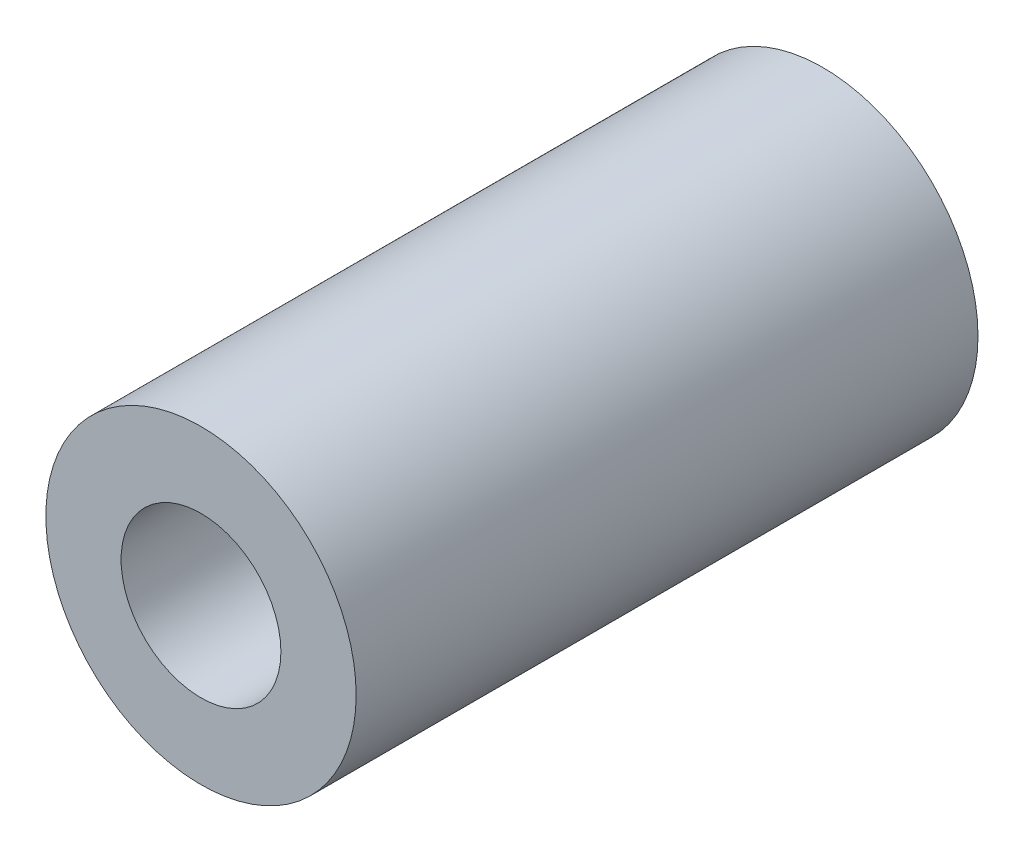
ISO-10303-21;
HEADER;
FILE_DESCRIPTION(('STEP AP214'),'2;1');
FILE_NAME('part.step','',(''),(''),'','','');
FILE_SCHEMA(('AUTOMOTIVE_DESIGN { 1 0 10303 214 1 1 1 1 }'));
ENDSEC;
DATA;
#1=APPLICATION_CONTEXT('core data for automotive mechanical design processes');
#2=APPLICATION_PROTOCOL_DEFINITION('international standard','automotive_design',2000,#1);
#3=PRODUCT_CONTEXT('',#1,'mechanical');
#4=PRODUCT('Part','Part','',(#3));
#5=PRODUCT_RELATED_PRODUCT_CATEGORY('part','',(#4));
#6=PRODUCT_DEFINITION_FORMATION('','',#4);
#7=PRODUCT_DEFINITION_CONTEXT('part definition',#1,'design');
#8=PRODUCT_DEFINITION('design','',#6,#7);
#9=PRODUCT_DEFINITION_SHAPE('','',#8);
#10=(LENGTH_UNIT() NAMED_UNIT(*) SI_UNIT(.MILLI.,.METRE.));
#11=(NAMED_UNIT(*) PLANE_ANGLE_UNIT() SI_UNIT($,.RADIAN.));
#12=(NAMED_UNIT(*) SI_UNIT($,.STERADIAN.) SOLID_ANGLE_UNIT());
#13=UNCERTAINTY_MEASURE_WITH_UNIT(LENGTH_MEASURE(1.E-05),#10,'distance_accuracy_value','');
#14=(GEOMETRIC_REPRESENTATION_CONTEXT(3) GLOBAL_UNCERTAINTY_ASSIGNED_CONTEXT((#13)) GLOBAL_UNIT_ASSIGNED_CONTEXT((#10,
#11,#12)) REPRESENTATION_CONTEXT('',''));
#15=CARTESIAN_POINT('',(0.,0.,0.));
#16=DIRECTION('',(0.,0.,1.));
#17=DIRECTION('',(1.,0.,0.));
#18=AXIS2_PLACEMENT_3D('',#15,#16,#17);
#19=CARTESIAN_POINT('',(59.1947374631264,-18.4066948635746,43.3245912176541));
#20=DIRECTION('',(0.,0.,-1.));
#21=DIRECTION('',(-1.,0.,0.));
#22=AXIS2_PLACEMENT_3D('',#19,#20,#21);
#23=CYLINDRICAL_SURFACE('',#22,6.3373);
#24=CARTESIAN_POINT('',(59.1947374631264,-18.4066948635746,0.));
#25=DIRECTION('',(0.,0.,1.));
#26=DIRECTION('',(1.,0.,0.));
#27=AXIS2_PLACEMENT_3D('',#24,#25,#26);
#28=CIRCLE('',#27,6.3373);
#29=CARTESIAN_POINT('',(65.5320374631264,-18.4066948635746,0.));
#30=VERTEX_POINT('',#29);
#31=EDGE_CURVE('E46',#30,#30,#28,.T.);
#32=ORIENTED_EDGE('',*,*,#31,.T.);
#33=EDGE_LOOP('',(#32));
#34=FACE_BOUND('',#33,.T.);
#35=CARTESIAN_POINT('',(59.1947374631264,-18.4066948635746,25.4));
#36=DIRECTION('',(0.,0.,1.));
#37=DIRECTION('',(1.,0.,0.));
#38=AXIS2_PLACEMENT_3D('',#35,#36,#37);
#39=CIRCLE('',#38,6.3373);
#40=CARTESIAN_POINT('',(65.5320374631264,-18.4066948635746,25.4));
#41=VERTEX_POINT('',#40);
#42=EDGE_CURVE('E10',#41,#41,#39,.T.);
#43=ORIENTED_EDGE('',*,*,#42,.F.);
#44=EDGE_LOOP('',(#43));
#45=FACE_BOUND('',#44,.T.);
#46=ADVANCED_FACE('F35',(#34,#45),#23,.T.);
#47=CARTESIAN_POINT('',(59.1947374631264,-18.4066948635746,0.));
#48=DIRECTION('',(0.,0.,1.));
#49=DIRECTION('',(1.,0.,0.));
#50=AXIS2_PLACEMENT_3D('',#47,#48,#49);
#51=PLANE('',#50);
#52=ORIENTED_EDGE('',*,*,#31,.F.);
#53=EDGE_LOOP('',(#52));
#54=FACE_BOUND('',#53,.T.);
#55=CARTESIAN_POINT('',(59.1947374631264,-18.4066948635746,0.));
#56=DIRECTION('',(0.,0.,1.));
#57=DIRECTION('',(1.,0.,0.));
#58=AXIS2_PLACEMENT_3D('',#55,#56,#57);
#59=CIRCLE('',#58,3.2639);
#60=CARTESIAN_POINT('',(62.4586374631264,-18.4066948635746,0.));
#61=VERTEX_POINT('',#60);
#62=EDGE_CURVE('E48',#61,#61,#59,.T.);
#63=ORIENTED_EDGE('',*,*,#62,.T.);
#64=EDGE_LOOP('',(#63));
#65=FACE_BOUND('',#64,.T.);
#66=ADVANCED_FACE('F55',(#54,#65),#51,.F.);
#67=CARTESIAN_POINT('',(59.1947374631264,-18.4066948635746,43.3245912176541));
#68=DIRECTION('',(0.,0.,-1.));
#69=DIRECTION('',(-1.,0.,0.));
#70=AXIS2_PLACEMENT_3D('',#67,#68,#69);
#71=CYLINDRICAL_SURFACE('',#70,3.2639);
#72=ORIENTED_EDGE('',*,*,#62,.F.);
#73=EDGE_LOOP('',(#72));
#74=FACE_BOUND('',#73,.T.);
#75=CARTESIAN_POINT('',(59.1947374631264,-18.4066948635746,25.4));
#76=DIRECTION('',(0.,0.,1.));
#77=DIRECTION('',(1.,0.,0.));
#78=AXIS2_PLACEMENT_3D('',#75,#76,#77);
#79=CIRCLE('',#78,3.2639);
#80=CARTESIAN_POINT('',(62.4586374631264,-18.4066948635746,25.4));
#81=VERTEX_POINT('',#80);
#82=EDGE_CURVE('E38',#81,#81,#79,.T.);
#83=ORIENTED_EDGE('',*,*,#82,.T.);
#84=EDGE_LOOP('',(#83));
#85=FACE_BOUND('',#84,.T.);
#86=ADVANCED_FACE('F58',(#74,#85),#71,.F.);
#87=CARTESIAN_POINT('',(0.,0.,25.4));
#88=DIRECTION('',(0.,0.,1.));
#89=DIRECTION('',(1.,0.,0.));
#90=AXIS2_PLACEMENT_3D('',#87,#88,#89);
#91=PLANE('',#90);
#92=ORIENTED_EDGE('',*,*,#82,.F.);
#93=EDGE_LOOP('',(#92));
#94=FACE_BOUND('',#93,.T.);
#95=ORIENTED_EDGE('',*,*,#42,.T.);
#96=EDGE_LOOP('',(#95));
#97=FACE_BOUND('',#96,.T.);
#98=ADVANCED_FACE('F63',(#94,#97),#91,.T.);
#99=CLOSED_SHELL('',(#46,#66,#86,#98));
#100=MANIFOLD_SOLID_BREP('B2',#99);
#101=ADVANCED_BREP_SHAPE_REPRESENTATION('',(#18,#100),#14);
#102=SHAPE_DEFINITION_REPRESENTATION(#9,#101);
ENDSEC;
END-ISO-10303-21;
